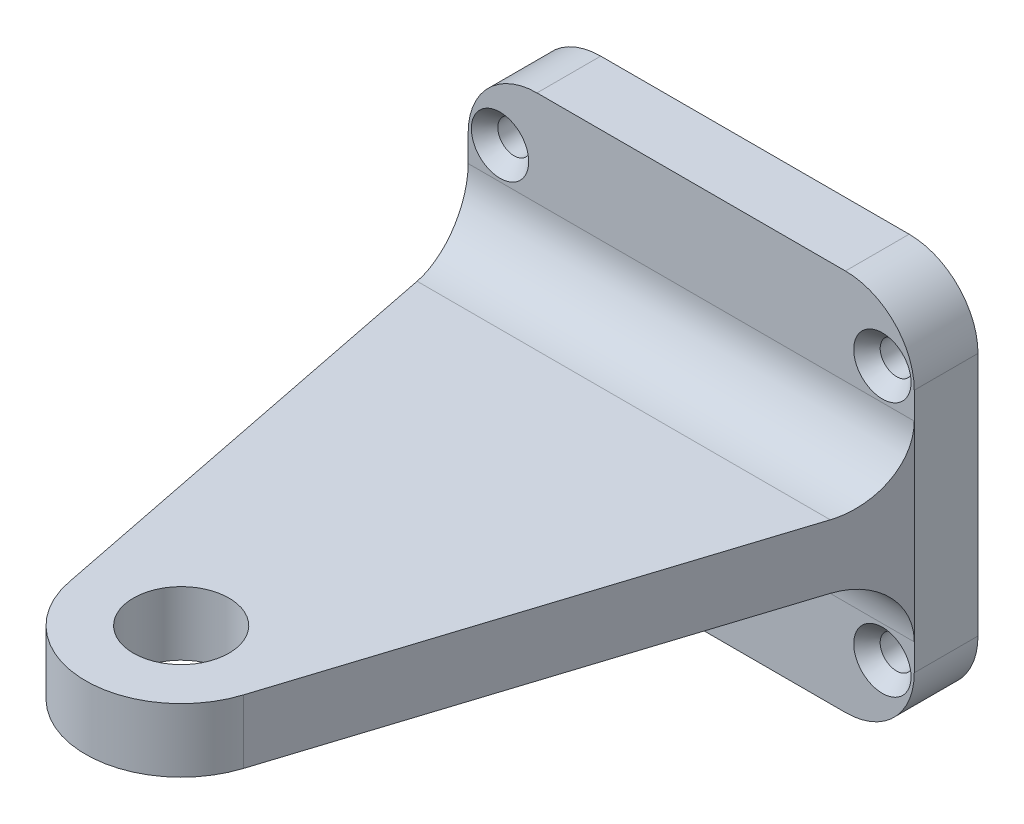
ISO-10303-21;
HEADER;
FILE_DESCRIPTION(('STEP AP214'),'2;1');
FILE_NAME('part.step','',(''),(''),'','','');
FILE_SCHEMA(('AUTOMOTIVE_DESIGN { 1 0 10303 214 1 1 1 1 }'));
ENDSEC;
DATA;
#1=APPLICATION_CONTEXT('core data for automotive mechanical design processes');
#2=APPLICATION_PROTOCOL_DEFINITION('international standard','automotive_design',2000,#1);
#3=PRODUCT_CONTEXT('',#1,'mechanical');
#4=PRODUCT('Part','Part','',(#3));
#5=PRODUCT_RELATED_PRODUCT_CATEGORY('part','',(#4));
#6=PRODUCT_DEFINITION_FORMATION('','',#4);
#7=PRODUCT_DEFINITION_CONTEXT('part definition',#1,'design');
#8=PRODUCT_DEFINITION('design','',#6,#7);
#9=PRODUCT_DEFINITION_SHAPE('','',#8);
#10=(LENGTH_UNIT() NAMED_UNIT(*) SI_UNIT(.MILLI.,.METRE.));
#11=(NAMED_UNIT(*) PLANE_ANGLE_UNIT() SI_UNIT($,.RADIAN.));
#12=(NAMED_UNIT(*) SI_UNIT($,.STERADIAN.) SOLID_ANGLE_UNIT());
#13=UNCERTAINTY_MEASURE_WITH_UNIT(LENGTH_MEASURE(1.E-05),#10,'distance_accuracy_value','');
#14=(GEOMETRIC_REPRESENTATION_CONTEXT(3) GLOBAL_UNCERTAINTY_ASSIGNED_CONTEXT((#13)) GLOBAL_UNIT_ASSIGNED_CONTEXT((#10,
#11,#12)) REPRESENTATION_CONTEXT('',''));
#15=CARTESIAN_POINT('',(0.,0.,0.));
#16=DIRECTION('',(0.,0.,1.));
#17=DIRECTION('',(1.,0.,0.));
#18=AXIS2_PLACEMENT_3D('',#15,#16,#17);
#19=CARTESIAN_POINT('',(0.,0.,6.35));
#20=DIRECTION('',(0.,0.,-1.));
#21=DIRECTION('',(-1.,0.,0.));
#22=AXIS2_PLACEMENT_3D('',#19,#20,#21);
#23=PLANE('',#22);
#24=CARTESIAN_POINT('',(-19.05,12.7,6.35));
#25=DIRECTION('',(0.,0.,1.));
#26=DIRECTION('',(1.,0.,0.));
#27=AXIS2_PLACEMENT_3D('',#24,#25,#26);
#28=CIRCLE('',#27,2.8575);
#29=CARTESIAN_POINT('',(-16.1925,12.7,6.35));
#30=VERTEX_POINT('',#29);
#31=EDGE_CURVE('E167',#30,#30,#28,.T.);
#32=ORIENTED_EDGE('',*,*,#31,.F.);
#33=EDGE_LOOP('',(#32));
#34=FACE_BOUND('',#33,.T.);
#35=CARTESIAN_POINT('',(19.05,12.7,6.35));
#36=DIRECTION('',(0.,0.,1.));
#37=DIRECTION('',(1.,0.,0.));
#38=AXIS2_PLACEMENT_3D('',#35,#36,#37);
#39=CIRCLE('',#38,2.8575);
#40=CARTESIAN_POINT('',(21.9075,12.7,6.35));
#41=VERTEX_POINT('',#40);
#42=EDGE_CURVE('E198',#41,#41,#39,.T.);
#43=ORIENTED_EDGE('',*,*,#42,.F.);
#44=EDGE_LOOP('',(#43));
#45=FACE_BOUND('',#44,.T.);
#46=DIRECTION('',(0.,-1.,0.));
#47=VECTOR('',#46,1.);
#48=CARTESIAN_POINT('',(-22.225,-19.05,6.35));
#49=LINE('',#48,#47);
#50=CARTESIAN_POINT('',(-22.225,12.192,6.35));
#51=VERTEX_POINT('',#50);
#52=CARTESIAN_POINT('',(-22.225,9.52499999999999,6.35));
#53=VERTEX_POINT('',#52);
#54=EDGE_CURVE('E215',#51,#53,#49,.T.);
#55=ORIENTED_EDGE('',*,*,#54,.T.);
#56=DIRECTION('',(-1.,0.,0.));
#57=VECTOR('',#56,1.);
#58=CARTESIAN_POINT('',(0.,9.525,6.35));
#59=LINE('',#58,#57);
#60=CARTESIAN_POINT('',(22.225,9.525,6.35));
#61=VERTEX_POINT('',#60);
#62=EDGE_CURVE('E271',#53,#61,#59,.F.);
#63=ORIENTED_EDGE('',*,*,#62,.T.);
#64=DIRECTION('',(0.,1.,0.));
#65=VECTOR('',#64,1.);
#66=CARTESIAN_POINT('',(22.225,-19.05,6.35));
#67=LINE('',#66,#65);
#68=CARTESIAN_POINT('',(22.225,12.192,6.35));
#69=VERTEX_POINT('',#68);
#70=EDGE_CURVE('E211',#61,#69,#67,.T.);
#71=ORIENTED_EDGE('',*,*,#70,.T.);
#72=CARTESIAN_POINT('',(15.367,12.192,6.35));
#73=DIRECTION('',(0.,0.,-1.));
#74=DIRECTION('',(-1.,0.,0.));
#75=AXIS2_PLACEMENT_3D('',#72,#73,#74);
#76=CIRCLE('',#75,6.858);
#77=CARTESIAN_POINT('',(15.367,19.05,6.35));
#78=VERTEX_POINT('',#77);
#79=EDGE_CURVE('E250',#69,#78,#76,.F.);
#80=ORIENTED_EDGE('',*,*,#79,.T.);
#81=DIRECTION('',(-1.,0.,0.));
#82=VECTOR('',#81,1.);
#83=CARTESIAN_POINT('',(-22.225,19.05,6.35));
#84=LINE('',#83,#82);
#85=CARTESIAN_POINT('',(-15.367,19.05,6.35));
#86=VERTEX_POINT('',#85);
#87=EDGE_CURVE('E210',#78,#86,#84,.T.);
#88=ORIENTED_EDGE('',*,*,#87,.T.);
#89=CARTESIAN_POINT('',(-15.367,12.192,6.35));
#90=DIRECTION('',(0.,0.,-1.));
#91=DIRECTION('',(-1.,0.,0.));
#92=AXIS2_PLACEMENT_3D('',#89,#90,#91);
#93=CIRCLE('',#92,6.858);
#94=EDGE_CURVE('E252',#86,#51,#93,.F.);
#95=ORIENTED_EDGE('',*,*,#94,.T.);
#96=EDGE_LOOP('',(#55,#63,#71,#80,#88,#95));
#97=FACE_BOUND('',#96,.T.);
#98=ADVANCED_FACE('F33',(#34,#45,#97),#23,.F.);
#99=CARTESIAN_POINT('',(22.225,-12.192,6.35));
#100=VERTEX_POINT('',#99);
#101=CARTESIAN_POINT('',(22.225,-9.525,6.35));
#102=VERTEX_POINT('',#101);
#103=EDGE_CURVE('E208',#100,#102,#67,.T.);
#104=ORIENTED_EDGE('',*,*,#103,.T.);
#105=DIRECTION('',(-1.,0.,0.));
#106=VECTOR('',#105,1.);
#107=CARTESIAN_POINT('',(-22.225,-9.525,6.35));
#108=LINE('',#107,#106);
#109=CARTESIAN_POINT('',(-22.225,-9.525,6.35));
#110=VERTEX_POINT('',#109);
#111=EDGE_CURVE('E274',#102,#110,#108,.T.);
#112=ORIENTED_EDGE('',*,*,#111,.T.);
#113=CARTESIAN_POINT('',(-22.225,-12.192,6.35));
#114=VERTEX_POINT('',#113);
#115=EDGE_CURVE('E214',#110,#114,#49,.T.);
#116=ORIENTED_EDGE('',*,*,#115,.T.);
#117=CARTESIAN_POINT('',(-15.367,-12.192,6.35));
#118=DIRECTION('',(0.,0.,-1.));
#119=DIRECTION('',(-1.,0.,0.));
#120=AXIS2_PLACEMENT_3D('',#117,#118,#119);
#121=CIRCLE('',#120,6.858);
#122=CARTESIAN_POINT('',(-15.367,-19.05,6.35));
#123=VERTEX_POINT('',#122);
#124=EDGE_CURVE('E261',#114,#123,#121,.F.);
#125=ORIENTED_EDGE('',*,*,#124,.T.);
#126=DIRECTION('',(1.,0.,0.));
#127=VECTOR('',#126,1.);
#128=CARTESIAN_POINT('',(-22.225,-19.05,6.35));
#129=LINE('',#128,#127);
#130=CARTESIAN_POINT('',(15.367,-19.05,6.35));
#131=VERTEX_POINT('',#130);
#132=EDGE_CURVE('E217',#123,#131,#129,.T.);
#133=ORIENTED_EDGE('',*,*,#132,.T.);
#134=CARTESIAN_POINT('',(15.367,-12.192,6.35));
#135=DIRECTION('',(0.,0.,-1.));
#136=DIRECTION('',(-1.,0.,0.));
#137=AXIS2_PLACEMENT_3D('',#134,#135,#136);
#138=CIRCLE('',#137,6.858);
#139=EDGE_CURVE('E259',#131,#100,#138,.F.);
#140=ORIENTED_EDGE('',*,*,#139,.T.);
#141=EDGE_LOOP('',(#104,#112,#116,#125,#133,#140));
#142=FACE_BOUND('',#141,.T.);
#143=CARTESIAN_POINT('',(-19.05,-12.7,6.35));
#144=DIRECTION('',(0.,0.,1.));
#145=DIRECTION('',(1.,0.,0.));
#146=AXIS2_PLACEMENT_3D('',#143,#144,#145);
#147=CIRCLE('',#146,2.8575);
#148=CARTESIAN_POINT('',(-16.1925,-12.7,6.35));
#149=VERTEX_POINT('',#148);
#150=EDGE_CURVE('E189',#149,#149,#147,.T.);
#151=ORIENTED_EDGE('',*,*,#150,.F.);
#152=EDGE_LOOP('',(#151));
#153=FACE_BOUND('',#152,.T.);
#154=CARTESIAN_POINT('',(19.05,-12.7,6.35));
#155=DIRECTION('',(0.,0.,1.));
#156=DIRECTION('',(1.,0.,0.));
#157=AXIS2_PLACEMENT_3D('',#154,#155,#156);
#158=CIRCLE('',#157,2.8575);
#159=CARTESIAN_POINT('',(21.9075,-12.7,6.35));
#160=VERTEX_POINT('',#159);
#161=EDGE_CURVE('E180',#160,#160,#158,.T.);
#162=ORIENTED_EDGE('',*,*,#161,.F.);
#163=EDGE_LOOP('',(#162));
#164=FACE_BOUND('',#163,.T.);
#165=ADVANCED_FACE('F318',(#142,#153,#164),#23,.F.);
#166=CARTESIAN_POINT('',(22.225,-19.05,6.35));
#167=DIRECTION('',(-1.,0.,0.));
#168=DIRECTION('',(0.,0.,1.));
#169=AXIS2_PLACEMENT_3D('',#166,#167,#168);
#170=PLANE('',#169);
#171=ORIENTED_EDGE('',*,*,#103,.F.);
#172=DIRECTION('',(0.,0.,-1.));
#173=VECTOR('',#172,1.);
#174=CARTESIAN_POINT('',(22.225,-12.192,6.35));
#175=LINE('',#174,#173);
#176=CARTESIAN_POINT('',(22.225,-12.192,0.));
#177=VERTEX_POINT('',#176);
#178=EDGE_CURVE('E266',#100,#177,#175,.T.);
#179=ORIENTED_EDGE('',*,*,#178,.T.);
#180=DIRECTION('',(0.,1.,0.));
#181=VECTOR('',#180,1.);
#182=CARTESIAN_POINT('',(22.225,-19.05,0.));
#183=LINE('',#182,#181);
#184=CARTESIAN_POINT('',(22.225,12.192,0.));
#185=VERTEX_POINT('',#184);
#186=EDGE_CURVE('E207',#177,#185,#183,.T.);
#187=ORIENTED_EDGE('',*,*,#186,.T.);
#188=DIRECTION('',(0.,0.,-1.));
#189=VECTOR('',#188,1.);
#190=CARTESIAN_POINT('',(22.225,12.192,6.35));
#191=LINE('',#190,#189);
#192=EDGE_CURVE('E263',#185,#69,#191,.F.);
#193=ORIENTED_EDGE('',*,*,#192,.T.);
#194=ORIENTED_EDGE('',*,*,#70,.F.);
#195=DIRECTION('',(0.,-1.,0.));
#196=VECTOR('',#195,1.);
#197=CARTESIAN_POINT('',(22.225,3.175,6.35));
#198=LINE('',#197,#196);
#199=EDGE_CURVE('E48',#61,#102,#198,.T.);
#200=ORIENTED_EDGE('',*,*,#199,.T.);
#201=EDGE_LOOP('',(#171,#179,#187,#193,#194,#200));
#202=FACE_BOUND('',#201,.T.);
#203=ADVANCED_FACE('F286',(#202),#170,.F.);
#204=CARTESIAN_POINT('',(-22.225,19.05,6.35));
#205=DIRECTION('',(0.,-1.,0.));
#206=DIRECTION('',(0.,0.,-1.));
#207=AXIS2_PLACEMENT_3D('',#204,#205,#206);
#208=PLANE('',#207);
#209=DIRECTION('',(-1.,0.,0.));
#210=VECTOR('',#209,1.);
#211=CARTESIAN_POINT('',(-22.225,19.05,0.));
#212=LINE('',#211,#210);
#213=CARTESIAN_POINT('',(15.367,19.05,0.));
#214=VERTEX_POINT('',#213);
#215=CARTESIAN_POINT('',(-15.367,19.05,0.));
#216=VERTEX_POINT('',#215);
#217=EDGE_CURVE('E223',#214,#216,#212,.T.);
#218=ORIENTED_EDGE('',*,*,#217,.T.);
#219=DIRECTION('',(0.,0.,-1.));
#220=VECTOR('',#219,1.);
#221=CARTESIAN_POINT('',(-15.367,19.05,6.35));
#222=LINE('',#221,#220);
#223=EDGE_CURVE('E248',#216,#86,#222,.F.);
#224=ORIENTED_EDGE('',*,*,#223,.T.);
#225=ORIENTED_EDGE('',*,*,#87,.F.);
#226=DIRECTION('',(0.,0.,-1.));
#227=VECTOR('',#226,1.);
#228=CARTESIAN_POINT('',(15.367,19.05,6.35));
#229=LINE('',#228,#227);
#230=EDGE_CURVE('E245',#78,#214,#229,.T.);
#231=ORIENTED_EDGE('',*,*,#230,.T.);
#232=EDGE_LOOP('',(#218,#224,#225,#231));
#233=FACE_BOUND('',#232,.T.);
#234=ADVANCED_FACE('F296',(#233),#208,.F.);
#235=CARTESIAN_POINT('',(-22.225,-19.05,6.35));
#236=DIRECTION('',(1.,0.,0.));
#237=DIRECTION('',(0.,0.,-1.));
#238=AXIS2_PLACEMENT_3D('',#235,#236,#237);
#239=PLANE('',#238);
#240=ORIENTED_EDGE('',*,*,#54,.F.);
#241=DIRECTION('',(0.,0.,-1.));
#242=VECTOR('',#241,1.);
#243=CARTESIAN_POINT('',(-22.225,12.192,6.35));
#244=LINE('',#243,#242);
#245=CARTESIAN_POINT('',(-22.225,12.192,0.));
#246=VERTEX_POINT('',#245);
#247=EDGE_CURVE('E234',#51,#246,#244,.T.);
#248=ORIENTED_EDGE('',*,*,#247,.T.);
#249=DIRECTION('',(0.,-1.,0.));
#250=VECTOR('',#249,1.);
#251=CARTESIAN_POINT('',(-22.225,-19.05,0.));
#252=LINE('',#251,#250);
#253=CARTESIAN_POINT('',(-22.225,-12.192,0.));
#254=VERTEX_POINT('',#253);
#255=EDGE_CURVE('E226',#246,#254,#252,.T.);
#256=ORIENTED_EDGE('',*,*,#255,.T.);
#257=DIRECTION('',(0.,0.,-1.));
#258=VECTOR('',#257,1.);
#259=CARTESIAN_POINT('',(-22.225,-12.192,6.35));
#260=LINE('',#259,#258);
#261=EDGE_CURVE('E220',#254,#114,#260,.F.);
#262=ORIENTED_EDGE('',*,*,#261,.T.);
#263=ORIENTED_EDGE('',*,*,#115,.F.);
#264=DIRECTION('',(0.,-1.,0.));
#265=VECTOR('',#264,1.);
#266=CARTESIAN_POINT('',(-22.225,3.175,6.35));
#267=LINE('',#266,#265);
#268=EDGE_CURVE('E57',#53,#110,#267,.T.);
#269=ORIENTED_EDGE('',*,*,#268,.F.);
#270=EDGE_LOOP('',(#240,#248,#256,#262,#263,#269));
#271=FACE_BOUND('',#270,.T.);
#272=ADVANCED_FACE('F302',(#271),#239,.F.);
#273=CARTESIAN_POINT('',(-22.225,-19.05,6.35));
#274=DIRECTION('',(0.,1.,0.));
#275=DIRECTION('',(0.,0.,1.));
#276=AXIS2_PLACEMENT_3D('',#273,#274,#275);
#277=PLANE('',#276);
#278=ORIENTED_EDGE('',*,*,#132,.F.);
#279=DIRECTION('',(0.,0.,-1.));
#280=VECTOR('',#279,1.);
#281=CARTESIAN_POINT('',(-15.367,-19.05,6.35));
#282=LINE('',#281,#280);
#283=CARTESIAN_POINT('',(-15.367,-19.05,0.));
#284=VERTEX_POINT('',#283);
#285=EDGE_CURVE('E256',#123,#284,#282,.T.);
#286=ORIENTED_EDGE('',*,*,#285,.T.);
#287=DIRECTION('',(1.,0.,0.));
#288=VECTOR('',#287,1.);
#289=CARTESIAN_POINT('',(-22.225,-19.05,0.));
#290=LINE('',#289,#288);
#291=CARTESIAN_POINT('',(15.367,-19.05,0.));
#292=VERTEX_POINT('',#291);
#293=EDGE_CURVE('E229',#284,#292,#290,.T.);
#294=ORIENTED_EDGE('',*,*,#293,.T.);
#295=DIRECTION('',(0.,0.,-1.));
#296=VECTOR('',#295,1.);
#297=CARTESIAN_POINT('',(15.367,-19.05,6.35));
#298=LINE('',#297,#296);
#299=EDGE_CURVE('E254',#292,#131,#298,.F.);
#300=ORIENTED_EDGE('',*,*,#299,.T.);
#301=EDGE_LOOP('',(#278,#286,#294,#300));
#302=FACE_BOUND('',#301,.T.);
#303=ADVANCED_FACE('F314',(#302),#277,.F.);
#304=CARTESIAN_POINT('',(0.,0.,0.));
#305=DIRECTION('',(0.,0.,-1.));
#306=DIRECTION('',(-1.,0.,0.));
#307=AXIS2_PLACEMENT_3D('',#304,#305,#306);
#308=PLANE('',#307);
#309=CARTESIAN_POINT('',(-19.05,12.7,0.));
#310=DIRECTION('',(0.,0.,-1.));
#311=DIRECTION('',(-1.,0.,0.));
#312=AXIS2_PLACEMENT_3D('',#309,#310,#311);
#313=CIRCLE('',#312,1.63194999999999);
#314=CARTESIAN_POINT('',(-20.68195,12.7,0.));
#315=VERTEX_POINT('',#314);
#316=EDGE_CURVE('E177',#315,#315,#313,.T.);
#317=ORIENTED_EDGE('',*,*,#316,.F.);
#318=EDGE_LOOP('',(#317));
#319=FACE_BOUND('',#318,.T.);
#320=CARTESIAN_POINT('',(19.05,-12.7,0.));
#321=DIRECTION('',(0.,0.,-1.));
#322=DIRECTION('',(-1.,0.,0.));
#323=AXIS2_PLACEMENT_3D('',#320,#321,#322);
#324=CIRCLE('',#323,1.63194999999999);
#325=CARTESIAN_POINT('',(17.41805,-12.7,0.));
#326=VERTEX_POINT('',#325);
#327=EDGE_CURVE('E186',#326,#326,#324,.T.);
#328=ORIENTED_EDGE('',*,*,#327,.F.);
#329=EDGE_LOOP('',(#328));
#330=FACE_BOUND('',#329,.T.);
#331=CARTESIAN_POINT('',(-19.05,-12.7,0.));
#332=DIRECTION('',(0.,0.,-1.));
#333=DIRECTION('',(-1.,0.,0.));
#334=AXIS2_PLACEMENT_3D('',#331,#332,#333);
#335=CIRCLE('',#334,1.63194999999999);
#336=CARTESIAN_POINT('',(-20.68195,-12.7,0.));
#337=VERTEX_POINT('',#336);
#338=EDGE_CURVE('E195',#337,#337,#335,.T.);
#339=ORIENTED_EDGE('',*,*,#338,.F.);
#340=EDGE_LOOP('',(#339));
#341=FACE_BOUND('',#340,.T.);
#342=CARTESIAN_POINT('',(19.05,12.7,0.));
#343=DIRECTION('',(0.,0.,-1.));
#344=DIRECTION('',(-1.,0.,0.));
#345=AXIS2_PLACEMENT_3D('',#342,#343,#344);
#346=CIRCLE('',#345,1.63194999999999);
#347=CARTESIAN_POINT('',(17.41805,12.7,0.));
#348=VERTEX_POINT('',#347);
#349=EDGE_CURVE('E204',#348,#348,#346,.T.);
#350=ORIENTED_EDGE('',*,*,#349,.F.);
#351=EDGE_LOOP('',(#350));
#352=FACE_BOUND('',#351,.T.);
#353=ORIENTED_EDGE('',*,*,#255,.F.);
#354=CARTESIAN_POINT('',(-15.367,12.192,0.));
#355=DIRECTION('',(0.,0.,-1.));
#356=DIRECTION('',(-1.,0.,0.));
#357=AXIS2_PLACEMENT_3D('',#354,#355,#356);
#358=CIRCLE('',#357,6.858);
#359=EDGE_CURVE('E243',#246,#216,#358,.T.);
#360=ORIENTED_EDGE('',*,*,#359,.T.);
#361=ORIENTED_EDGE('',*,*,#217,.F.);
#362=CARTESIAN_POINT('',(15.367,12.192,0.));
#363=DIRECTION('',(0.,0.,-1.));
#364=DIRECTION('',(-1.,0.,0.));
#365=AXIS2_PLACEMENT_3D('',#362,#363,#364);
#366=CIRCLE('',#365,6.858);
#367=EDGE_CURVE('E237',#214,#185,#366,.T.);
#368=ORIENTED_EDGE('',*,*,#367,.T.);
#369=ORIENTED_EDGE('',*,*,#186,.F.);
#370=CARTESIAN_POINT('',(15.367,-12.192,0.));
#371=DIRECTION('',(0.,0.,-1.));
#372=DIRECTION('',(-1.,0.,0.));
#373=AXIS2_PLACEMENT_3D('',#370,#371,#372);
#374=CIRCLE('',#373,6.858);
#375=EDGE_CURVE('E239',#177,#292,#374,.T.);
#376=ORIENTED_EDGE('',*,*,#375,.T.);
#377=ORIENTED_EDGE('',*,*,#293,.F.);
#378=CARTESIAN_POINT('',(-15.367,-12.192,0.));
#379=DIRECTION('',(0.,0.,-1.));
#380=DIRECTION('',(-1.,0.,0.));
#381=AXIS2_PLACEMENT_3D('',#378,#379,#380);
#382=CIRCLE('',#381,6.858);
#383=EDGE_CURVE('E241',#284,#254,#382,.T.);
#384=ORIENTED_EDGE('',*,*,#383,.T.);
#385=EDGE_LOOP('',(#353,#360,#361,#368,#369,#376,#377,#384));
#386=FACE_BOUND('',#385,.T.);
#387=ADVANCED_FACE('F306',(#319,#330,#341,#352,#386),#308,.T.);
#388=CARTESIAN_POINT('',(19.05,12.7,6.35));
#389=DIRECTION('',(0.,0.,1.));
#390=DIRECTION('',(1.,0.,0.));
#391=AXIS2_PLACEMENT_3D('',#388,#389,#390);
#392=CYLINDRICAL_SURFACE('',#391,1.63194999999999);
#393=CARTESIAN_POINT('',(19.05,12.7,4.94016599853027));
#394=DIRECTION('',(0.,0.,1.));
#395=DIRECTION('',(1.,0.,0.));
#396=AXIS2_PLACEMENT_3D('',#393,#394,#395);
#397=CIRCLE('',#396,1.63194999999999);
#398=CARTESIAN_POINT('',(20.68195,12.7,4.94016599853027));
#399=VERTEX_POINT('',#398);
#400=EDGE_CURVE('E201',#399,#399,#397,.T.);
#401=ORIENTED_EDGE('',*,*,#400,.T.);
#402=EDGE_LOOP('',(#401));
#403=FACE_BOUND('',#402,.T.);
#404=ORIENTED_EDGE('',*,*,#349,.T.);
#405=EDGE_LOOP('',(#404));
#406=FACE_BOUND('',#405,.T.);
#407=ADVANCED_FACE('F367',(#403,#406),#392,.F.);
#408=CARTESIAN_POINT('',(19.05,12.7,6.35));
#409=DIRECTION('',(0.,0.,1.));
#410=DIRECTION('',(1.,0.,0.));
#411=AXIS2_PLACEMENT_3D('',#408,#409,#410);
#412=CONICAL_SURFACE('',#411,2.8575,0.715584993317673);
#413=ORIENTED_EDGE('',*,*,#400,.F.);
#414=EDGE_LOOP('',(#413));
#415=FACE_BOUND('',#414,.T.);
#416=ORIENTED_EDGE('',*,*,#42,.T.);
#417=EDGE_LOOP('',(#416));
#418=FACE_BOUND('',#417,.T.);
#419=ADVANCED_FACE('F562',(#415,#418),#412,.F.);
#420=CARTESIAN_POINT('',(-19.05,-12.7,6.35));
#421=DIRECTION('',(0.,0.,1.));
#422=DIRECTION('',(1.,0.,0.));
#423=AXIS2_PLACEMENT_3D('',#420,#421,#422);
#424=CYLINDRICAL_SURFACE('',#423,1.63194999999999);
#425=CARTESIAN_POINT('',(-19.05,-12.7,4.94016599853027));
#426=DIRECTION('',(0.,0.,1.));
#427=DIRECTION('',(1.,0.,0.));
#428=AXIS2_PLACEMENT_3D('',#425,#426,#427);
#429=CIRCLE('',#428,1.63194999999999);
#430=CARTESIAN_POINT('',(-17.41805,-12.7,4.94016599853027));
#431=VERTEX_POINT('',#430);
#432=EDGE_CURVE('E192',#431,#431,#429,.T.);
#433=ORIENTED_EDGE('',*,*,#432,.T.);
#434=EDGE_LOOP('',(#433));
#435=FACE_BOUND('',#434,.T.);
#436=ORIENTED_EDGE('',*,*,#338,.T.);
#437=EDGE_LOOP('',(#436));
#438=FACE_BOUND('',#437,.T.);
#439=ADVANCED_FACE('F552',(#435,#438),#424,.F.);
#440=CARTESIAN_POINT('',(-19.05,-12.7,6.35));
#441=DIRECTION('',(0.,0.,1.));
#442=DIRECTION('',(1.,0.,0.));
#443=AXIS2_PLACEMENT_3D('',#440,#441,#442);
#444=CONICAL_SURFACE('',#443,2.8575,0.715584993317673);
#445=ORIENTED_EDGE('',*,*,#432,.F.);
#446=EDGE_LOOP('',(#445));
#447=FACE_BOUND('',#446,.T.);
#448=ORIENTED_EDGE('',*,*,#150,.T.);
#449=EDGE_LOOP('',(#448));
#450=FACE_BOUND('',#449,.T.);
#451=ADVANCED_FACE('F542',(#447,#450),#444,.F.);
#452=CARTESIAN_POINT('',(19.05,-12.7,6.35));
#453=DIRECTION('',(0.,0.,1.));
#454=DIRECTION('',(1.,0.,0.));
#455=AXIS2_PLACEMENT_3D('',#452,#453,#454);
#456=CYLINDRICAL_SURFACE('',#455,1.63194999999999);
#457=CARTESIAN_POINT('',(19.05,-12.7,4.94016599853027));
#458=DIRECTION('',(0.,0.,1.));
#459=DIRECTION('',(1.,0.,0.));
#460=AXIS2_PLACEMENT_3D('',#457,#458,#459);
#461=CIRCLE('',#460,1.63194999999999);
#462=CARTESIAN_POINT('',(20.68195,-12.7,4.94016599853027));
#463=VERTEX_POINT('',#462);
#464=EDGE_CURVE('E183',#463,#463,#461,.T.);
#465=ORIENTED_EDGE('',*,*,#464,.T.);
#466=EDGE_LOOP('',(#465));
#467=FACE_BOUND('',#466,.T.);
#468=ORIENTED_EDGE('',*,*,#327,.T.);
#469=EDGE_LOOP('',(#468));
#470=FACE_BOUND('',#469,.T.);
#471=ADVANCED_FACE('F532',(#467,#470),#456,.F.);
#472=CARTESIAN_POINT('',(19.05,-12.7,6.35));
#473=DIRECTION('',(0.,0.,1.));
#474=DIRECTION('',(1.,0.,0.));
#475=AXIS2_PLACEMENT_3D('',#472,#473,#474);
#476=CONICAL_SURFACE('',#475,2.8575,0.715584993317673);
#477=ORIENTED_EDGE('',*,*,#464,.F.);
#478=EDGE_LOOP('',(#477));
#479=FACE_BOUND('',#478,.T.);
#480=ORIENTED_EDGE('',*,*,#161,.T.);
#481=EDGE_LOOP('',(#480));
#482=FACE_BOUND('',#481,.T.);
#483=ADVANCED_FACE('F522',(#479,#482),#476,.F.);
#484=CARTESIAN_POINT('',(-19.05,12.7,6.35));
#485=DIRECTION('',(0.,0.,1.));
#486=DIRECTION('',(1.,0.,0.));
#487=AXIS2_PLACEMENT_3D('',#484,#485,#486);
#488=CYLINDRICAL_SURFACE('',#487,1.63194999999999);
#489=CARTESIAN_POINT('',(-19.05,12.7,4.94016599853027));
#490=DIRECTION('',(0.,0.,1.));
#491=DIRECTION('',(1.,0.,0.));
#492=AXIS2_PLACEMENT_3D('',#489,#490,#491);
#493=CIRCLE('',#492,1.63194999999999);
#494=CARTESIAN_POINT('',(-17.41805,12.7,4.94016599853027));
#495=VERTEX_POINT('',#494);
#496=EDGE_CURVE('E170',#495,#495,#493,.T.);
#497=ORIENTED_EDGE('',*,*,#496,.T.);
#498=EDGE_LOOP('',(#497));
#499=FACE_BOUND('',#498,.T.);
#500=ORIENTED_EDGE('',*,*,#316,.T.);
#501=EDGE_LOOP('',(#500));
#502=FACE_BOUND('',#501,.T.);
#503=ADVANCED_FACE('F512',(#499,#502),#488,.F.);
#504=CARTESIAN_POINT('',(-19.05,12.7,6.35));
#505=DIRECTION('',(0.,0.,1.));
#506=DIRECTION('',(1.,0.,0.));
#507=AXIS2_PLACEMENT_3D('',#504,#505,#506);
#508=CONICAL_SURFACE('',#507,2.8575,0.715584993317673);
#509=ORIENTED_EDGE('',*,*,#496,.F.);
#510=EDGE_LOOP('',(#509));
#511=FACE_BOUND('',#510,.T.);
#512=ORIENTED_EDGE('',*,*,#31,.T.);
#513=EDGE_LOOP('',(#512));
#514=FACE_BOUND('',#513,.T.);
#515=ADVANCED_FACE('F430',(#511,#514),#508,.F.);
#516=CARTESIAN_POINT('',(-2.99999996999999,3.175,54.168));
#517=DIRECTION('',(0.,1.,0.));
#518=DIRECTION('',(0.,0.,1.));
#519=AXIS2_PLACEMENT_3D('',#516,#517,#518);
#520=PLANE('',#519);
#521=DIRECTION('',(0.303453627616886,0.,-0.952846207887796));
#522=VECTOR('',#521,1.);
#523=CARTESIAN_POINT('',(6.07586016013126,3.175,57.0583958030508));
#524=LINE('',#523,#522);
#525=CARTESIAN_POINT('',(6.07586016013126,3.175,57.0583958030508));
#526=VERTEX_POINT('',#525);
#527=CARTESIAN_POINT('',(20.2027108630797,3.175,12.7));
#528=VERTEX_POINT('',#527);
#529=EDGE_CURVE('E140',#526,#528,#524,.T.);
#530=ORIENTED_EDGE('',*,*,#529,.T.);
#531=DIRECTION('',(-1.,0.,0.));
#532=VECTOR('',#531,1.);
#533=CARTESIAN_POINT('',(-2.99999996999999,3.175,12.7));
#534=LINE('',#533,#532);
#535=CARTESIAN_POINT('',(-20.9616760373726,3.175,12.7));
#536=VERTEX_POINT('',#535);
#537=EDGE_CURVE('E269',#528,#536,#534,.T.);
#538=ORIENTED_EDGE('',*,*,#537,.T.);
#539=DIRECTION('',(0.195124557947654,0.,0.980778469831864));
#540=VECTOR('',#539,1.);
#541=CARTESIAN_POINT('',(-12.3419148951485,3.175,56.0265614144514));
#542=LINE('',#541,#540);
#543=CARTESIAN_POINT('',(-12.3419148951485,3.175,56.0265614144514));
#544=VERTEX_POINT('',#543);
#545=EDGE_CURVE('E152',#536,#544,#542,.T.);
#546=ORIENTED_EDGE('',*,*,#545,.T.);
#547=CARTESIAN_POINT('',(-2.99999996999999,3.175,54.168));
#548=DIRECTION('',(0.,1.,0.));
#549=DIRECTION('',(0.,0.,1.));
#550=AXIS2_PLACEMENT_3D('',#547,#548,#549);
#551=CIRCLE('',#550,9.525);
#552=EDGE_CURVE('E153',#544,#526,#551,.T.);
#553=ORIENTED_EDGE('',*,*,#552,.T.);
#554=EDGE_LOOP('',(#530,#538,#546,#553));
#555=FACE_BOUND('',#554,.T.);
#556=CARTESIAN_POINT('',(-2.99999996999999,3.175,54.168));
#557=DIRECTION('',(0.,1.,0.));
#558=DIRECTION('',(0.,0.,1.));
#559=AXIS2_PLACEMENT_3D('',#556,#557,#558);
#560=CIRCLE('',#559,4.7625);
#561=CARTESIAN_POINT('',(-2.99999996999999,3.175,58.9305));
#562=VERTEX_POINT('',#561);
#563=EDGE_CURVE('E337',#562,#562,#560,.T.);
#564=ORIENTED_EDGE('',*,*,#563,.F.);
#565=EDGE_LOOP('',(#564));
#566=FACE_BOUND('',#565,.T.);
#567=ADVANCED_FACE('F156',(#555,#566),#520,.T.);
#568=CARTESIAN_POINT('',(-2.99999996999999,-3.175,54.168));
#569=DIRECTION('',(0.,1.,0.));
#570=DIRECTION('',(0.,0.,1.));
#571=AXIS2_PLACEMENT_3D('',#568,#569,#570);
#572=PLANE('',#571);
#573=DIRECTION('',(0.195124557947654,0.,0.980778469831864));
#574=VECTOR('',#573,1.);
#575=CARTESIAN_POINT('',(-12.3419148951485,-3.175,56.0265614144514));
#576=LINE('',#575,#574);
#577=CARTESIAN_POINT('',(-20.9616760373726,-3.175,12.7));
#578=VERTEX_POINT('',#577);
#579=CARTESIAN_POINT('',(-12.3419148951485,-3.175,56.0265614144514));
#580=VERTEX_POINT('',#579);
#581=EDGE_CURVE('E162',#578,#580,#576,.T.);
#582=ORIENTED_EDGE('',*,*,#581,.F.);
#583=DIRECTION('',(-1.,0.,0.));
#584=VECTOR('',#583,1.);
#585=CARTESIAN_POINT('',(22.225,-3.175,12.7));
#586=LINE('',#585,#584);
#587=CARTESIAN_POINT('',(20.2027108630797,-3.175,12.7));
#588=VERTEX_POINT('',#587);
#589=EDGE_CURVE('E277',#578,#588,#586,.F.);
#590=ORIENTED_EDGE('',*,*,#589,.T.);
#591=DIRECTION('',(0.303453627616886,0.,-0.952846207887796));
#592=VECTOR('',#591,1.);
#593=CARTESIAN_POINT('',(6.07586016013126,-3.175,57.0583958030508));
#594=LINE('',#593,#592);
#595=CARTESIAN_POINT('',(6.07586016013126,-3.175,57.0583958030508));
#596=VERTEX_POINT('',#595);
#597=EDGE_CURVE('E325',#596,#588,#594,.T.);
#598=ORIENTED_EDGE('',*,*,#597,.F.);
#599=CARTESIAN_POINT('',(-2.99999996999999,-3.175,54.168));
#600=DIRECTION('',(0.,1.,0.));
#601=DIRECTION('',(0.,0.,1.));
#602=AXIS2_PLACEMENT_3D('',#599,#600,#601);
#603=CIRCLE('',#602,9.525);
#604=EDGE_CURVE('E166',#580,#596,#603,.T.);
#605=ORIENTED_EDGE('',*,*,#604,.F.);
#606=EDGE_LOOP('',(#582,#590,#598,#605));
#607=FACE_BOUND('',#606,.T.);
#608=CARTESIAN_POINT('',(-2.99999996999999,-3.175,54.168));
#609=DIRECTION('',(0.,1.,0.));
#610=DIRECTION('',(0.,0.,1.));
#611=AXIS2_PLACEMENT_3D('',#608,#609,#610);
#612=CIRCLE('',#611,4.7625);
#613=CARTESIAN_POINT('',(-2.99999996999999,-3.175,58.9305));
#614=VERTEX_POINT('',#613);
#615=EDGE_CURVE('E339',#614,#614,#612,.T.);
#616=ORIENTED_EDGE('',*,*,#615,.T.);
#617=EDGE_LOOP('',(#616));
#618=FACE_BOUND('',#617,.T.);
#619=ADVANCED_FACE('F329',(#607,#618),#572,.F.);
#620=CARTESIAN_POINT('',(-2.99999996999999,3.175,54.168));
#621=DIRECTION('',(0.,-1.,0.));
#622=DIRECTION('',(0.,0.,-1.));
#623=AXIS2_PLACEMENT_3D('',#620,#621,#622);
#624=CYLINDRICAL_SURFACE('',#623,9.525);
#625=ORIENTED_EDGE('',*,*,#604,.T.);
#626=DIRECTION('',(0.,-1.,0.));
#627=VECTOR('',#626,1.);
#628=CARTESIAN_POINT('',(6.07586016013126,3.175,57.0583958030508));
#629=LINE('',#628,#627);
#630=EDGE_CURVE('E145',#526,#596,#629,.T.);
#631=ORIENTED_EDGE('',*,*,#630,.F.);
#632=ORIENTED_EDGE('',*,*,#552,.F.);
#633=DIRECTION('',(0.,-1.,0.));
#634=VECTOR('',#633,1.);
#635=CARTESIAN_POINT('',(-12.3419148951485,3.175,56.0265614144514));
#636=LINE('',#635,#634);
#637=EDGE_CURVE('E335',#544,#580,#636,.T.);
#638=ORIENTED_EDGE('',*,*,#637,.T.);
#639=EDGE_LOOP('',(#625,#631,#632,#638));
#640=FACE_BOUND('',#639,.T.);
#641=ADVANCED_FACE('F164',(#640),#624,.T.);
#642=CARTESIAN_POINT('',(6.07586016013126,3.175,57.0583958030508));
#643=DIRECTION('',(-0.952846207887796,0.,-0.303453627616886));
#644=DIRECTION('',(-0.303453627616886,0.,0.952846207887796));
#645=AXIS2_PLACEMENT_3D('',#642,#643,#644);
#646=PLANE('',#645);
#647=ORIENTED_EDGE('',*,*,#597,.T.);
#648=CARTESIAN_POINT('',(20.2027108630797,-9.525,12.7));
#649=DIRECTION('',(-0.952846207887796,0.,-0.303453627616886));
#650=DIRECTION('',(0.303453627616886,0.,-0.952846207887796));
#651=AXIS2_PLACEMENT_3D('',#648,#649,#650);
#652=ELLIPSE('',#651,6.6642443947762,6.35);
#653=EDGE_CURVE('E11',#588,#102,#652,.T.);
#654=ORIENTED_EDGE('',*,*,#653,.T.);
#655=ORIENTED_EDGE('',*,*,#199,.F.);
#656=CARTESIAN_POINT('',(20.2027108630797,9.525,12.7));
#657=DIRECTION('',(-0.952846207887796,0.,-0.303453627616886));
#658=DIRECTION('',(-0.303453627616886,0.,0.952846207887796));
#659=AXIS2_PLACEMENT_3D('',#656,#657,#658);
#660=ELLIPSE('',#659,6.6642443947762,6.35);
#661=EDGE_CURVE('E148',#61,#528,#660,.T.);
#662=ORIENTED_EDGE('',*,*,#661,.T.);
#663=ORIENTED_EDGE('',*,*,#529,.F.);
#664=ORIENTED_EDGE('',*,*,#630,.T.);
#665=EDGE_LOOP('',(#647,#654,#655,#662,#663,#664));
#666=FACE_BOUND('',#665,.T.);
#667=ADVANCED_FACE('F143',(#666),#646,.F.);
#668=CARTESIAN_POINT('',(-12.3419148951485,3.175,56.0265614144514));
#669=DIRECTION('',(0.980778469831864,0.,-0.195124557947654));
#670=DIRECTION('',(-0.195124557947654,0.,-0.980778469831864));
#671=AXIS2_PLACEMENT_3D('',#668,#669,#670);
#672=PLANE('',#671);
#673=ORIENTED_EDGE('',*,*,#268,.T.);
#674=CARTESIAN_POINT('',(-20.9616760373726,-9.525,12.7));
#675=DIRECTION('',(0.980778469831864,0.,-0.195124557947654));
#676=DIRECTION('',(0.195124557947654,0.,0.980778469831864));
#677=AXIS2_PLACEMENT_3D('',#674,#675,#676);
#678=ELLIPSE('',#677,6.47444881318468,6.35);
#679=EDGE_CURVE('E41',#110,#578,#678,.T.);
#680=ORIENTED_EDGE('',*,*,#679,.T.);
#681=ORIENTED_EDGE('',*,*,#581,.T.);
#682=ORIENTED_EDGE('',*,*,#637,.F.);
#683=ORIENTED_EDGE('',*,*,#545,.F.);
#684=CARTESIAN_POINT('',(-20.9616760373726,9.525,12.7));
#685=DIRECTION('',(0.980778469831864,0.,-0.195124557947654));
#686=DIRECTION('',(-0.195124557947654,0.,-0.980778469831864));
#687=AXIS2_PLACEMENT_3D('',#684,#685,#686);
#688=ELLIPSE('',#687,6.47444881318468,6.35);
#689=EDGE_CURVE('E279',#536,#53,#688,.T.);
#690=ORIENTED_EDGE('',*,*,#689,.T.);
#691=EDGE_LOOP('',(#673,#680,#681,#682,#683,#690));
#692=FACE_BOUND('',#691,.T.);
#693=ADVANCED_FACE('F282',(#692),#672,.F.);
#694=CARTESIAN_POINT('',(-2.99999996999999,3.175,54.168));
#695=DIRECTION('',(0.,-1.,0.));
#696=DIRECTION('',(0.,0.,-1.));
#697=AXIS2_PLACEMENT_3D('',#694,#695,#696);
#698=CYLINDRICAL_SURFACE('',#697,4.7625);
#699=ORIENTED_EDGE('',*,*,#563,.T.);
#700=EDGE_LOOP('',(#699));
#701=FACE_BOUND('',#700,.T.);
#702=ORIENTED_EDGE('',*,*,#615,.F.);
#703=EDGE_LOOP('',(#702));
#704=FACE_BOUND('',#703,.T.);
#705=ADVANCED_FACE('F347',(#701,#704),#698,.F.);
#706=CARTESIAN_POINT('',(-15.367,12.192,6.35));
#707=DIRECTION('',(0.,0.,-1.));
#708=DIRECTION('',(-1.,0.,0.));
#709=AXIS2_PLACEMENT_3D('',#706,#707,#708);
#710=CYLINDRICAL_SURFACE('',#709,6.858);
#711=ORIENTED_EDGE('',*,*,#94,.F.);
#712=ORIENTED_EDGE('',*,*,#223,.F.);
#713=ORIENTED_EDGE('',*,*,#359,.F.);
#714=ORIENTED_EDGE('',*,*,#247,.F.);
#715=EDGE_LOOP('',(#711,#712,#713,#714));
#716=FACE_BOUND('',#715,.T.);
#717=ADVANCED_FACE('F300',(#716),#710,.T.);
#718=CARTESIAN_POINT('',(-15.367,-12.192,6.35));
#719=DIRECTION('',(0.,0.,-1.));
#720=DIRECTION('',(-1.,0.,0.));
#721=AXIS2_PLACEMENT_3D('',#718,#719,#720);
#722=CYLINDRICAL_SURFACE('',#721,6.858);
#723=ORIENTED_EDGE('',*,*,#124,.F.);
#724=ORIENTED_EDGE('',*,*,#261,.F.);
#725=ORIENTED_EDGE('',*,*,#383,.F.);
#726=ORIENTED_EDGE('',*,*,#285,.F.);
#727=EDGE_LOOP('',(#723,#724,#725,#726));
#728=FACE_BOUND('',#727,.T.);
#729=ADVANCED_FACE('F311',(#728),#722,.T.);
#730=CARTESIAN_POINT('',(15.367,-12.192,6.35));
#731=DIRECTION('',(0.,0.,-1.));
#732=DIRECTION('',(-1.,0.,0.));
#733=AXIS2_PLACEMENT_3D('',#730,#731,#732);
#734=CYLINDRICAL_SURFACE('',#733,6.858);
#735=ORIENTED_EDGE('',*,*,#139,.F.);
#736=ORIENTED_EDGE('',*,*,#299,.F.);
#737=ORIENTED_EDGE('',*,*,#375,.F.);
#738=ORIENTED_EDGE('',*,*,#178,.F.);
#739=EDGE_LOOP('',(#735,#736,#737,#738));
#740=FACE_BOUND('',#739,.T.);
#741=ADVANCED_FACE('F322',(#740),#734,.T.);
#742=CARTESIAN_POINT('',(15.367,12.192,6.35));
#743=DIRECTION('',(0.,0.,-1.));
#744=DIRECTION('',(-1.,0.,0.));
#745=AXIS2_PLACEMENT_3D('',#742,#743,#744);
#746=CYLINDRICAL_SURFACE('',#745,6.858);
#747=ORIENTED_EDGE('',*,*,#79,.F.);
#748=ORIENTED_EDGE('',*,*,#192,.F.);
#749=ORIENTED_EDGE('',*,*,#367,.F.);
#750=ORIENTED_EDGE('',*,*,#230,.F.);
#751=EDGE_LOOP('',(#747,#748,#749,#750));
#752=FACE_BOUND('',#751,.T.);
#753=ADVANCED_FACE('F292',(#752),#746,.T.);
#754=CARTESIAN_POINT('',(-2.99999996999999,9.525,12.7));
#755=DIRECTION('',(-1.,0.,0.));
#756=DIRECTION('',(0.,0.,1.));
#757=AXIS2_PLACEMENT_3D('',#754,#755,#756);
#758=CYLINDRICAL_SURFACE('',#757,6.35);
#759=ORIENTED_EDGE('',*,*,#661,.F.);
#760=ORIENTED_EDGE('',*,*,#62,.F.);
#761=ORIENTED_EDGE('',*,*,#689,.F.);
#762=ORIENTED_EDGE('',*,*,#537,.F.);
#763=EDGE_LOOP('',(#759,#760,#761,#762));
#764=FACE_BOUND('',#763,.T.);
#765=ADVANCED_FACE('F284',(#764),#758,.F.);
#766=CARTESIAN_POINT('',(0.,-9.525,12.7));
#767=DIRECTION('',(1.,0.,0.));
#768=DIRECTION('',(0.,0.,-1.));
#769=AXIS2_PLACEMENT_3D('',#766,#767,#768);
#770=CYLINDRICAL_SURFACE('',#769,6.35);
#771=ORIENTED_EDGE('',*,*,#653,.F.);
#772=ORIENTED_EDGE('',*,*,#589,.F.);
#773=ORIENTED_EDGE('',*,*,#679,.F.);
#774=ORIENTED_EDGE('',*,*,#111,.F.);
#775=EDGE_LOOP('',(#771,#772,#773,#774));
#776=FACE_BOUND('',#775,.T.);
#777=ADVANCED_FACE('F35',(#776),#770,.F.);
#778=CLOSED_SHELL('',(#98,#165,#203,#234,#272,#303,#387,#407,#419,#439,#451,#471,#483,#503,#515,
#567,#619,#641,#667,#693,#705,#717,#729,#741,#753,#765,#777));
#779=MANIFOLD_SOLID_BREP('B2',#778);
#780=ADVANCED_BREP_SHAPE_REPRESENTATION('',(#18,#779),#14);
#781=SHAPE_DEFINITION_REPRESENTATION(#9,#780);
ENDSEC;
END-ISO-10303-21;
